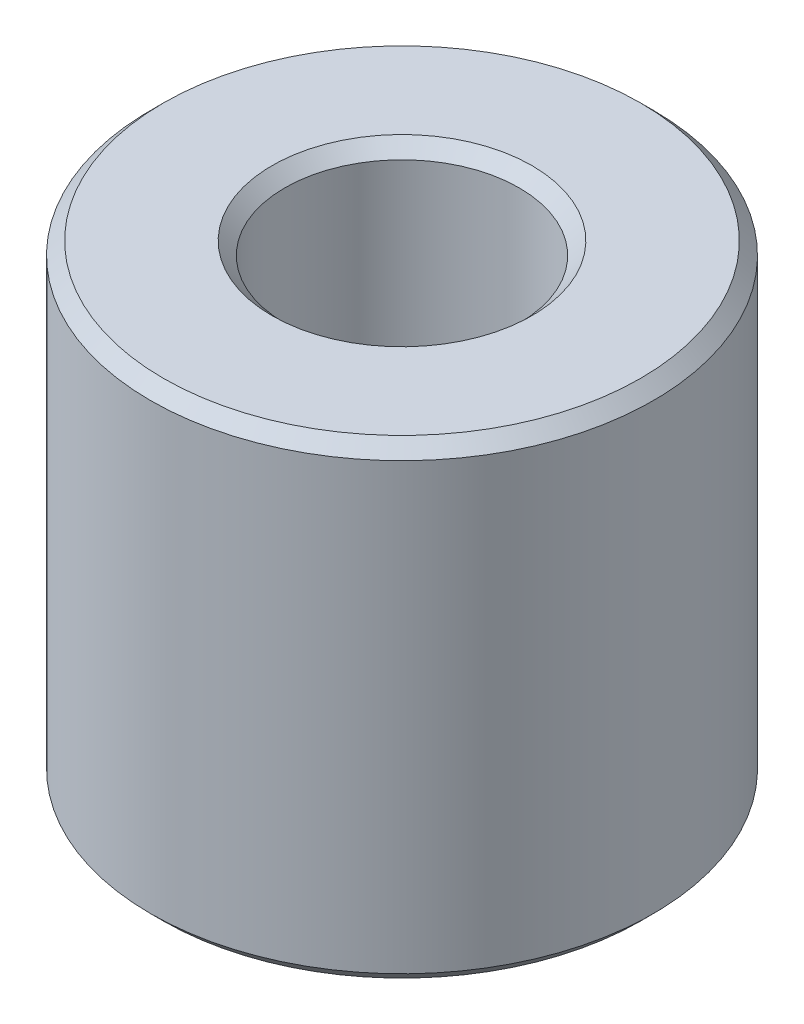
ISO-10303-21;
HEADER;
FILE_DESCRIPTION(('STEP AP214'),'2;1');
FILE_NAME('part.step','',(''),(''),'','','');
FILE_SCHEMA(('AUTOMOTIVE_DESIGN { 1 0 10303 214 1 1 1 1 }'));
ENDSEC;
DATA;
#1=APPLICATION_CONTEXT('core data for automotive mechanical design processes');
#2=APPLICATION_PROTOCOL_DEFINITION('international standard','automotive_design',2000,#1);
#3=PRODUCT_CONTEXT('',#1,'mechanical');
#4=PRODUCT('Part','Part','',(#3));
#5=PRODUCT_RELATED_PRODUCT_CATEGORY('part','',(#4));
#6=PRODUCT_DEFINITION_FORMATION('','',#4);
#7=PRODUCT_DEFINITION_CONTEXT('part definition',#1,'design');
#8=PRODUCT_DEFINITION('design','',#6,#7);
#9=PRODUCT_DEFINITION_SHAPE('','',#8);
#10=(LENGTH_UNIT() NAMED_UNIT(*) SI_UNIT(.MILLI.,.METRE.));
#11=(NAMED_UNIT(*) PLANE_ANGLE_UNIT() SI_UNIT($,.RADIAN.));
#12=(NAMED_UNIT(*) SI_UNIT($,.STERADIAN.) SOLID_ANGLE_UNIT());
#13=UNCERTAINTY_MEASURE_WITH_UNIT(LENGTH_MEASURE(1.E-05),#10,'distance_accuracy_value','');
#14=(GEOMETRIC_REPRESENTATION_CONTEXT(3) GLOBAL_UNCERTAINTY_ASSIGNED_CONTEXT((#13)) GLOBAL_UNIT_ASSIGNED_CONTEXT((#10,
#11,#12)) REPRESENTATION_CONTEXT('',''));
#15=CARTESIAN_POINT('',(0.,0.,0.));
#16=DIRECTION('',(0.,0.,1.));
#17=DIRECTION('',(1.,0.,0.));
#18=AXIS2_PLACEMENT_3D('',#15,#16,#17);
#19=CARTESIAN_POINT('',(0.,102.823793375809,0.));
#20=DIRECTION('',(0.,-1.,0.));
#21=DIRECTION('',(0.,0.,-1.));
#22=AXIS2_PLACEMENT_3D('',#19,#20,#21);
#23=CYLINDRICAL_SURFACE('',#22,55.);
#24=CARTESIAN_POINT('',(0.,2.80494173078992,0.));
#25=DIRECTION('',(0.,1.,0.));
#26=DIRECTION('',(0.,0.,1.));
#27=AXIS2_PLACEMENT_3D('',#24,#25,#26);
#28=CIRCLE('',#27,55.);
#29=CARTESIAN_POINT('',(0.,2.80494173078991,-55.));
#30=VERTEX_POINT('',#29);
#31=EDGE_CURVE('E10',#30,#30,#28,.T.);
#32=CARTESIAN_POINT('',(0.,100.018851645019,0.));
#33=DIRECTION('',(0.,1.,0.));
#34=DIRECTION('',(0.,0.,1.));
#35=AXIS2_PLACEMENT_3D('',#32,#33,#34);
#36=CIRCLE('',#35,55.);
#37=CARTESIAN_POINT('',(0.,100.018851645019,-55.));
#38=VERTEX_POINT('',#37);
#39=EDGE_CURVE('E50',#38,#38,#36,.F.);
#40=CARTESIAN_POINT('',(0.,2.80494173078991,-55.));
#41=CARTESIAN_POINT('',(0.,3.81758662572979,-55.));
#42=CARTESIAN_POINT('',(0.,4.83023152066968,-55.));
#43=CARTESIAN_POINT('',(0.,6.85552131054946,-55.));
#44=CARTESIAN_POINT('',(0.,7.86816620548935,-55.));
#45=CARTESIAN_POINT('',(0.,9.89345599536913,-55.));
#46=CARTESIAN_POINT('',(0.,10.906100890309,-55.));
#47=CARTESIAN_POINT('',(0.,12.9313906801888,-55.));
#48=CARTESIAN_POINT('',(0.,13.9440355751287,-55.));
#49=CARTESIAN_POINT('',(0.,15.9693253650085,-55.));
#50=CARTESIAN_POINT('',(0.,16.9819702599483,-55.));
#51=CARTESIAN_POINT('',(0.,19.0072600498281,-55.));
#52=CARTESIAN_POINT('',(0.,20.019904944768,-55.));
#53=CARTESIAN_POINT('',(0.,22.0451947346478,-55.));
#54=CARTESIAN_POINT('',(0.,23.0578396295877,-55.));
#55=CARTESIAN_POINT('',(0.,25.0831294194675,-55.));
#56=CARTESIAN_POINT('',(0.,26.0957743144073,-55.));
#57=CARTESIAN_POINT('',(0.,28.1210641042871,-55.));
#58=CARTESIAN_POINT('',(0.,29.133708999227,-55.));
#59=CARTESIAN_POINT('',(0.,31.1589987891068,-55.));
#60=CARTESIAN_POINT('',(0.,32.1716436840467,-55.));
#61=CARTESIAN_POINT('',(0.,34.1969334739264,-55.));
#62=CARTESIAN_POINT('',(0.,35.2095783688663,-55.));
#63=CARTESIAN_POINT('',(0.,37.2348681587461,-55.));
#64=CARTESIAN_POINT('',(0.,38.247513053686,-55.));
#65=CARTESIAN_POINT('',(0.,40.2728028435658,-55.));
#66=CARTESIAN_POINT('',(0.,41.2854477385057,-55.));
#67=CARTESIAN_POINT('',(0.,43.3107375283854,-55.));
#68=CARTESIAN_POINT('',(0.,44.3233824233253,-55.));
#69=CARTESIAN_POINT('',(0.,46.3486722132051,-55.));
#70=CARTESIAN_POINT('',(0.,47.361317108145,-55.));
#71=CARTESIAN_POINT('',(0.,49.3866068980248,-55.));
#72=CARTESIAN_POINT('',(0.,50.3992517929647,-55.));
#73=CARTESIAN_POINT('',(0.,52.4245415828444,-55.));
#74=CARTESIAN_POINT('',(0.,53.4371864777843,-55.));
#75=CARTESIAN_POINT('',(0.,55.4624762676641,-55.));
#76=CARTESIAN_POINT('',(0.,56.475121162604,-55.));
#77=CARTESIAN_POINT('',(0.,58.5004109524838,-55.));
#78=CARTESIAN_POINT('',(0.,59.5130558474237,-55.));
#79=CARTESIAN_POINT('',(0.,61.5383456373034,-55.));
#80=CARTESIAN_POINT('',(0.,62.5509905322433,-55.));
#81=CARTESIAN_POINT('',(0.,64.5762803221231,-55.));
#82=CARTESIAN_POINT('',(0.,65.588925217063,-55.));
#83=CARTESIAN_POINT('',(0.,67.6142150069428,-55.));
#84=CARTESIAN_POINT('',(0.,68.6268599018827,-55.));
#85=CARTESIAN_POINT('',(0.,70.6521496917624,-55.));
#86=CARTESIAN_POINT('',(0.,71.6647945867023,-55.));
#87=CARTESIAN_POINT('',(0.,73.6900843765821,-55.));
#88=CARTESIAN_POINT('',(0.,74.702729271522,-55.));
#89=CARTESIAN_POINT('',(0.,76.7280190614018,-55.));
#90=CARTESIAN_POINT('',(0.,77.7406639563417,-55.));
#91=CARTESIAN_POINT('',(0.,79.7659537462214,-55.));
#92=CARTESIAN_POINT('',(0.,80.7785986411613,-55.));
#93=CARTESIAN_POINT('',(0.,82.8038884310411,-55.));
#94=CARTESIAN_POINT('',(0.,83.816533325981,-55.));
#95=CARTESIAN_POINT('',(0.,85.8418231158608,-55.));
#96=CARTESIAN_POINT('',(0.,86.8544680108007,-55.));
#97=CARTESIAN_POINT('',(0.,88.8797578006804,-55.));
#98=CARTESIAN_POINT('',(0.,89.8924026956203,-55.));
#99=CARTESIAN_POINT('',(0.,91.9176924855001,-55.));
#100=CARTESIAN_POINT('',(0.,92.93033738044,-55.));
#101=CARTESIAN_POINT('',(0.,94.9556271703198,-55.));
#102=CARTESIAN_POINT('',(0.,95.9682720652597,-55.));
#103=CARTESIAN_POINT('',(0.,97.9935618551394,-55.));
#104=CARTESIAN_POINT('',(0.,99.0062067500793,-55.));
#105=CARTESIAN_POINT('',(0.,100.018851645019,-55.));
#106=B_SPLINE_CURVE_WITH_KNOTS('',3,(#40,#41,#42,#43,#44,#45,#46,#47,#48,#49,#50,#51,#52,#53,
#54,#55,#56,#57,#58,#59,#60,#61,#62,#63,#64,#65,#66,#67,#68,#69,#70,#71,#72,#73,#74,#75,#76,#77,
#78,#79,#80,#81,#82,#83,#84,#85,#86,#87,#88,#89,#90,#91,#92,#93,#94,#95,#96,#97,#98,#99,#100,
#101,#102,#103,#104,#105),.UNSPECIFIED.,.F.,.F.,(4,2,2,2,2,2,2,2,2,2,2,2,2,2,2,2,2,2,2,2,2,2,2,
2,2,2,2,2,2,2,2,2,4),(0.,3.03793468481967,6.07586936963933,9.113804054459,12.1517387392787,
15.1896734240983,18.227608108918,21.2655427937377,24.3034774785573,27.341412163377,
30.3793468481967,33.4172815330163,36.455216217836,39.4931509026557,42.5310855874753,
45.569020272295,48.6069549571147,51.6448896419343,54.682824326754,57.7207590115736,
60.7586936963933,63.796628381213,66.8345630660326,69.8724977508523,72.910432435672,
75.9483671204917,78.9863018053113,82.024236490131,85.0621711749506,88.1001058597703,
91.13804054459,94.1759752294096,97.2139099142293),.UNSPECIFIED.);
#107=EDGE_CURVE('BSEAM39',#30,#38,#106,.T.);
#108=ORIENTED_EDGE('',*,*,#31,.T.);
#109=ORIENTED_EDGE('',*,*,#39,.T.);
#110=ORIENTED_EDGE('',*,*,#107,.T.);
#111=ORIENTED_EDGE('',*,*,#107,.F.);
#112=EDGE_LOOP('',(#108,#110,#109,#111));
#113=FACE_BOUND('',#112,.T.);
#114=ADVANCED_FACE('F39',(#113),#23,.T.);
#115=CARTESIAN_POINT('',(0.,102.823793375809,0.));
#116=DIRECTION('',(0.,1.,0.));
#117=DIRECTION('',(0.,0.,1.));
#118=AXIS2_PLACEMENT_3D('',#115,#116,#117);
#119=PLANE('',#118);
#120=CARTESIAN_POINT('',(0.,102.823793375809,0.));
#121=DIRECTION('',(0.,1.,0.));
#122=DIRECTION('',(0.,0.,1.));
#123=AXIS2_PLACEMENT_3D('',#120,#121,#122);
#124=CIRCLE('',#123,28.4435573651915);
#125=CARTESIAN_POINT('',(0.,102.823793375809,28.4435573651915));
#126=VERTEX_POINT('',#125);
#127=EDGE_CURVE('E58',#126,#126,#124,.F.);
#128=ORIENTED_EDGE('',*,*,#127,.T.);
#129=EDGE_LOOP('',(#128));
#130=FACE_BOUND('',#129,.T.);
#131=CARTESIAN_POINT('',(0.,102.823793375809,0.));
#132=DIRECTION('',(0.,1.,0.));
#133=DIRECTION('',(0.,0.,1.));
#134=AXIS2_PLACEMENT_3D('',#131,#132,#133);
#135=CIRCLE('',#134,52.1950582692103);
#136=CARTESIAN_POINT('',(0.,102.823793375809,52.1950582692103));
#137=VERTEX_POINT('',#136);
#138=EDGE_CURVE('E61',#137,#137,#135,.T.);
#139=ORIENTED_EDGE('',*,*,#138,.T.);
#140=EDGE_LOOP('',(#139));
#141=FACE_BOUND('',#140,.T.);
#142=ADVANCED_FACE('F88',(#130,#141),#119,.T.);
#143=CARTESIAN_POINT('',(0.,0.,0.));
#144=DIRECTION('',(0.,1.,0.));
#145=DIRECTION('',(0.,0.,1.));
#146=AXIS2_PLACEMENT_3D('',#143,#144,#145);
#147=PLANE('',#146);
#148=CARTESIAN_POINT('',(0.,0.,0.));
#149=DIRECTION('',(0.,1.,0.));
#150=DIRECTION('',(0.,0.,1.));
#151=AXIS2_PLACEMENT_3D('',#148,#149,#150);
#152=CIRCLE('',#151,28.4435573651914);
#153=CARTESIAN_POINT('',(0.,0.,28.4435573651914));
#154=VERTEX_POINT('',#153);
#155=EDGE_CURVE('E51',#154,#154,#152,.T.);
#156=ORIENTED_EDGE('',*,*,#155,.T.);
#157=EDGE_LOOP('',(#156));
#158=FACE_BOUND('',#157,.T.);
#159=CARTESIAN_POINT('',(0.,0.,0.));
#160=DIRECTION('',(0.,1.,0.));
#161=DIRECTION('',(0.,0.,1.));
#162=AXIS2_PLACEMENT_3D('',#159,#160,#161);
#163=CIRCLE('',#162,52.1950582692101);
#164=CARTESIAN_POINT('',(0.,0.,52.1950582692101));
#165=VERTEX_POINT('',#164);
#166=EDGE_CURVE('E54',#165,#165,#163,.F.);
#167=ORIENTED_EDGE('',*,*,#166,.T.);
#168=EDGE_LOOP('',(#167));
#169=FACE_BOUND('',#168,.T.);
#170=ADVANCED_FACE('F83',(#158,#169),#147,.F.);
#171=CARTESIAN_POINT('',(0.,102.823793375809,0.));
#172=DIRECTION('',(0.,-1.,0.));
#173=DIRECTION('',(0.,0.,-1.));
#174=AXIS2_PLACEMENT_3D('',#171,#172,#173);
#175=CYLINDRICAL_SURFACE('',#174,25.6386156344016);
#176=CARTESIAN_POINT('',(0.,100.018851645019,0.));
#177=DIRECTION('',(0.,1.,0.));
#178=DIRECTION('',(0.,0.,1.));
#179=AXIS2_PLACEMENT_3D('',#176,#177,#178);
#180=CIRCLE('',#179,25.6386156344016);
#181=CARTESIAN_POINT('',(0.,100.018851645019,-25.6386156344016));
#182=VERTEX_POINT('',#181);
#183=EDGE_CURVE('E67',#182,#182,#180,.T.);
#184=CARTESIAN_POINT('',(0.,2.80494173078977,0.));
#185=DIRECTION('',(0.,1.,0.));
#186=DIRECTION('',(0.,0.,1.));
#187=AXIS2_PLACEMENT_3D('',#184,#185,#186);
#188=CIRCLE('',#187,25.6386156344016);
#189=CARTESIAN_POINT('',(0.,2.80494173078977,-25.6386156344016));
#190=VERTEX_POINT('',#189);
#191=EDGE_CURVE('E69',#190,#190,#188,.F.);
#192=CARTESIAN_POINT('',(0.,100.018851645019,-25.6386156344016));
#193=CARTESIAN_POINT('',(0.,99.0062067500791,-25.6386156344016));
#194=CARTESIAN_POINT('',(0.,97.9935618551393,-25.6386156344016));
#195=CARTESIAN_POINT('',(0.,95.9682720652595,-25.6386156344016));
#196=CARTESIAN_POINT('',(0.,94.9556271703196,-25.6386156344016));
#197=CARTESIAN_POINT('',(0.,92.9303373804398,-25.6386156344016));
#198=CARTESIAN_POINT('',(0.,91.9176924854999,-25.6386156344016));
#199=CARTESIAN_POINT('',(0.,89.8924026956201,-25.6386156344016));
#200=CARTESIAN_POINT('',(0.,88.8797578006803,-25.6386156344016));
#201=CARTESIAN_POINT('',(0.,86.8544680108005,-25.6386156344016));
#202=CARTESIAN_POINT('',(0.,85.8418231158606,-25.6386156344016));
#203=CARTESIAN_POINT('',(0.,83.8165333259808,-25.6386156344016));
#204=CARTESIAN_POINT('',(0.,82.8038884310409,-25.6386156344016));
#205=CARTESIAN_POINT('',(0.,80.7785986411612,-25.6386156344016));
#206=CARTESIAN_POINT('',(0.,79.7659537462213,-25.6386156344016));
#207=CARTESIAN_POINT('',(0.,77.7406639563415,-25.6386156344016));
#208=CARTESIAN_POINT('',(0.,76.7280190614016,-25.6386156344016));
#209=CARTESIAN_POINT('',(0.,74.7027292715218,-25.6386156344016));
#210=CARTESIAN_POINT('',(0.,73.690084376582,-25.6386156344016));
#211=CARTESIAN_POINT('',(0.,71.6647945867022,-25.6386156344016));
#212=CARTESIAN_POINT('',(0.,70.6521496917623,-25.6386156344016));
#213=CARTESIAN_POINT('',(0.,68.6268599018825,-25.6386156344016));
#214=CARTESIAN_POINT('',(0.,67.6142150069426,-25.6386156344016));
#215=CARTESIAN_POINT('',(0.,65.5889252170628,-25.6386156344016));
#216=CARTESIAN_POINT('',(0.,64.576280322123,-25.6386156344016));
#217=CARTESIAN_POINT('',(0.,62.5509905322432,-25.6386156344016));
#218=CARTESIAN_POINT('',(0.,61.5383456373033,-25.6386156344016));
#219=CARTESIAN_POINT('',(0.,59.5130558474235,-25.6386156344016));
#220=CARTESIAN_POINT('',(0.,58.5004109524836,-25.6386156344016));
#221=CARTESIAN_POINT('',(0.,56.4751211626038,-25.6386156344016));
#222=CARTESIAN_POINT('',(0.,55.462476267664,-25.6386156344016));
#223=CARTESIAN_POINT('',(0.,53.4371864777842,-25.6386156344016));
#224=CARTESIAN_POINT('',(0.,52.4245415828443,-25.6386156344016));
#225=CARTESIAN_POINT('',(0.,50.3992517929645,-25.6386156344016));
#226=CARTESIAN_POINT('',(0.,49.3866068980246,-25.6386156344016));
#227=CARTESIAN_POINT('',(0.,47.3613171081448,-25.6386156344016));
#228=CARTESIAN_POINT('',(0.,46.348672213205,-25.6386156344016));
#229=CARTESIAN_POINT('',(0.,44.3233824233252,-25.6386156344016));
#230=CARTESIAN_POINT('',(0.,43.3107375283853,-25.6386156344016));
#231=CARTESIAN_POINT('',(0.,41.2854477385055,-25.6386156344016));
#232=CARTESIAN_POINT('',(0.,40.2728028435656,-25.6386156344016));
#233=CARTESIAN_POINT('',(0.,38.2475130536859,-25.6386156344016));
#234=CARTESIAN_POINT('',(0.,37.234868158746,-25.6386156344016));
#235=CARTESIAN_POINT('',(0.,35.2095783688662,-25.6386156344016));
#236=CARTESIAN_POINT('',(0.,34.1969334739263,-25.6386156344016));
#237=CARTESIAN_POINT('',(0.,32.1716436840465,-25.6386156344016));
#238=CARTESIAN_POINT('',(0.,31.1589987891066,-25.6386156344016));
#239=CARTESIAN_POINT('',(0.,29.1337089992269,-25.6386156344016));
#240=CARTESIAN_POINT('',(0.,28.121064104287,-25.6386156344016));
#241=CARTESIAN_POINT('',(0.,26.0957743144072,-25.6386156344016));
#242=CARTESIAN_POINT('',(0.,25.0831294194673,-25.6386156344016));
#243=CARTESIAN_POINT('',(0.,23.0578396295875,-25.6386156344016));
#244=CARTESIAN_POINT('',(0.,22.0451947346476,-25.6386156344016));
#245=CARTESIAN_POINT('',(0.,20.0199049447679,-25.6386156344016));
#246=CARTESIAN_POINT('',(0.,19.007260049828,-25.6386156344016));
#247=CARTESIAN_POINT('',(0.,16.9819702599482,-25.6386156344016));
#248=CARTESIAN_POINT('',(0.,15.9693253650083,-25.6386156344016));
#249=CARTESIAN_POINT('',(0.,13.9440355751285,-25.6386156344016));
#250=CARTESIAN_POINT('',(0.,12.9313906801887,-25.6386156344016));
#251=CARTESIAN_POINT('',(0.,10.9061008903089,-25.6386156344016));
#252=CARTESIAN_POINT('',(0.,9.89345599536899,-25.6386156344016));
#253=CARTESIAN_POINT('',(0.,7.86816620548921,-25.6386156344016));
#254=CARTESIAN_POINT('',(0.,6.85552131054932,-25.6386156344016));
#255=CARTESIAN_POINT('',(0.,4.83023152066954,-25.6386156344016));
#256=CARTESIAN_POINT('',(0.,3.81758662572966,-25.6386156344016));
#257=CARTESIAN_POINT('',(0.,2.80494173078977,-25.6386156344016));
#258=B_SPLINE_CURVE_WITH_KNOTS('',3,(#192,#193,#194,#195,#196,#197,#198,#199,#200,#201,#202,
#203,#204,#205,#206,#207,#208,#209,#210,#211,#212,#213,#214,#215,#216,#217,#218,#219,#220,#221,
#222,#223,#224,#225,#226,#227,#228,#229,#230,#231,#232,#233,#234,#235,#236,#237,#238,#239,#240,
#241,#242,#243,#244,#245,#246,#247,#248,#249,#250,#251,#252,#253,#254,#255,#256,#257),
.UNSPECIFIED.,.F.,.F.,(4,2,2,2,2,2,2,2,2,2,2,2,2,2,2,2,2,2,2,2,2,2,2,2,2,2,2,2,2,2,2,2,4),(0.,
3.03793468481967,6.07586936963933,9.113804054459,12.1517387392787,15.1896734240983,
18.227608108918,21.2655427937377,24.3034774785573,27.341412163377,30.3793468481967,
33.4172815330163,36.455216217836,39.4931509026556,42.5310855874753,45.569020272295,
48.6069549571146,51.6448896419343,54.682824326754,57.7207590115736,60.7586936963933,
63.796628381213,66.8345630660326,69.8724977508523,72.910432435672,75.9483671204916,
78.9863018053113,82.0242364901309,85.0621711749506,88.1001058597703,91.1380405445899,
94.1759752294096,97.2139099142293),.UNSPECIFIED.);
#259=EDGE_CURVE('BSEAM71',#182,#190,#258,.T.);
#260=ORIENTED_EDGE('',*,*,#183,.T.);
#261=ORIENTED_EDGE('',*,*,#191,.T.);
#262=ORIENTED_EDGE('',*,*,#259,.T.);
#263=ORIENTED_EDGE('',*,*,#259,.F.);
#264=EDGE_LOOP('',(#260,#262,#261,#263));
#265=FACE_BOUND('',#264,.T.);
#266=ADVANCED_FACE('F71',(#265),#175,.F.);
#267=CARTESIAN_POINT('',(0.,100.018851645019,0.));
#268=DIRECTION('',(0.,1.,0.));
#269=DIRECTION('',(0.,0.,1.));
#270=AXIS2_PLACEMENT_3D('',#267,#268,#269);
#271=CONICAL_SURFACE('',#270,25.6386156344016,0.785398163397453);
#272=ORIENTED_EDGE('',*,*,#127,.F.);
#273=EDGE_LOOP('',(#272));
#274=FACE_BOUND('',#273,.T.);
#275=ORIENTED_EDGE('',*,*,#183,.F.);
#276=EDGE_LOOP('',(#275));
#277=FACE_BOUND('',#276,.T.);
#278=ADVANCED_FACE('F77',(#274,#277),#271,.F.);
#279=CARTESIAN_POINT('',(0.,0.,0.));
#280=DIRECTION('',(0.,-1.,0.));
#281=DIRECTION('',(0.,0.,-1.));
#282=AXIS2_PLACEMENT_3D('',#279,#280,#281);
#283=CONICAL_SURFACE('',#282,28.4435573651914,0.785398163397448);
#284=ORIENTED_EDGE('',*,*,#191,.F.);
#285=EDGE_LOOP('',(#284));
#286=FACE_BOUND('',#285,.T.);
#287=ORIENTED_EDGE('',*,*,#155,.F.);
#288=EDGE_LOOP('',(#287));
#289=FACE_BOUND('',#288,.T.);
#290=ADVANCED_FACE('F73',(#286,#289),#283,.F.);
#291=CARTESIAN_POINT('',(0.,2.80494173078992,0.));
#292=DIRECTION('',(0.,1.,0.));
#293=DIRECTION('',(0.,0.,1.));
#294=AXIS2_PLACEMENT_3D('',#291,#292,#293);
#295=CONICAL_SURFACE('',#294,55.,0.785398163397451);
#296=ORIENTED_EDGE('',*,*,#166,.F.);
#297=EDGE_LOOP('',(#296));
#298=FACE_BOUND('',#297,.T.);
#299=ORIENTED_EDGE('',*,*,#31,.F.);
#300=EDGE_LOOP('',(#299));
#301=FACE_BOUND('',#300,.T.);
#302=ADVANCED_FACE('F76',(#298,#301),#295,.T.);
#303=CARTESIAN_POINT('',(0.,102.823793375809,0.));
#304=DIRECTION('',(0.,-1.,0.));
#305=DIRECTION('',(0.,0.,-1.));
#306=AXIS2_PLACEMENT_3D('',#303,#304,#305);
#307=CONICAL_SURFACE('',#306,52.1950582692103,0.785398163397448);
#308=ORIENTED_EDGE('',*,*,#39,.F.);
#309=EDGE_LOOP('',(#308));
#310=FACE_BOUND('',#309,.T.);
#311=ORIENTED_EDGE('',*,*,#138,.F.);
#312=EDGE_LOOP('',(#311));
#313=FACE_BOUND('',#312,.T.);
#314=ADVANCED_FACE('F45',(#310,#313),#307,.T.);
#315=CLOSED_SHELL('',(#114,#142,#170,#266,#278,#290,#302,#314));
#316=MANIFOLD_SOLID_BREP('B2',#315);
#317=ADVANCED_BREP_SHAPE_REPRESENTATION('',(#18,#316),#14);
#318=SHAPE_DEFINITION_REPRESENTATION(#9,#317);
ENDSEC;
END-ISO-10303-21;
